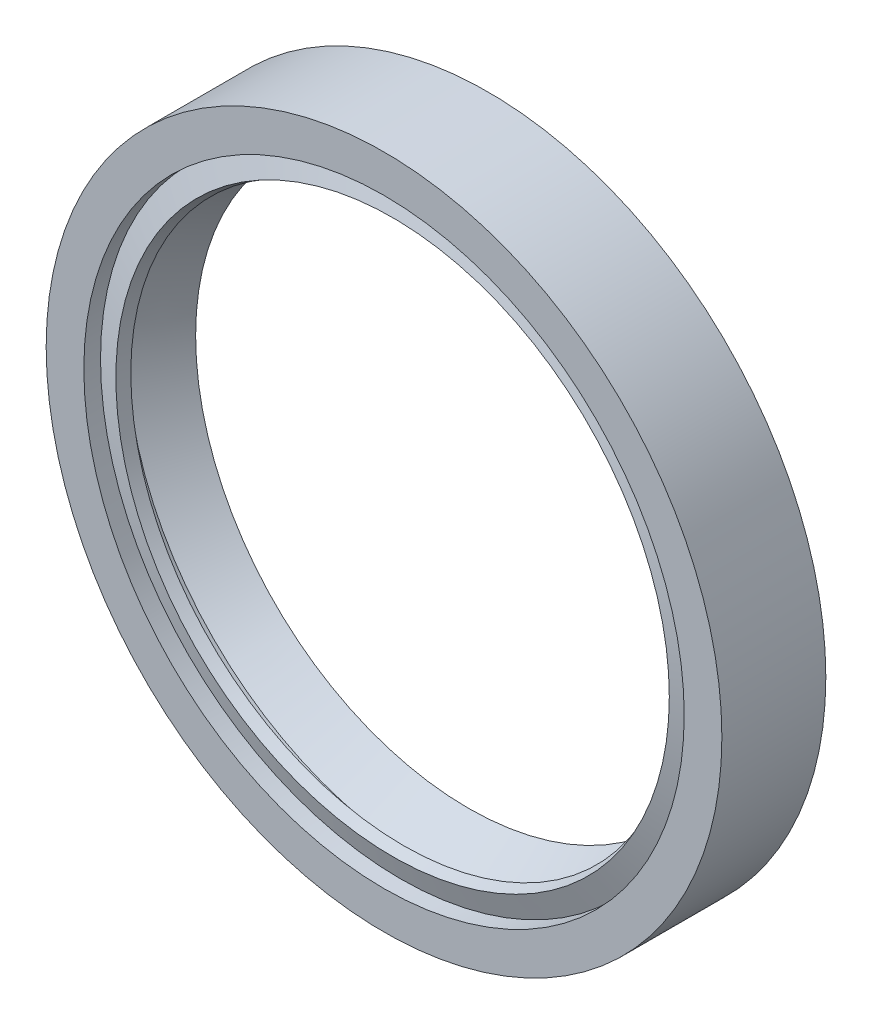
ISO-10303-21;
HEADER;
FILE_DESCRIPTION(('STEP AP214'),'2;1');
FILE_NAME('part.step','',(''),(''),'','','');
FILE_SCHEMA(('AUTOMOTIVE_DESIGN { 1 0 10303 214 1 1 1 1 }'));
ENDSEC;
DATA;
#1=APPLICATION_CONTEXT('core data for automotive mechanical design processes');
#2=APPLICATION_PROTOCOL_DEFINITION('international standard','automotive_design',2000,#1);
#3=PRODUCT_CONTEXT('',#1,'mechanical');
#4=PRODUCT('Part','Part','',(#3));
#5=PRODUCT_RELATED_PRODUCT_CATEGORY('part','',(#4));
#6=PRODUCT_DEFINITION_FORMATION('','',#4);
#7=PRODUCT_DEFINITION_CONTEXT('part definition',#1,'design');
#8=PRODUCT_DEFINITION('design','',#6,#7);
#9=PRODUCT_DEFINITION_SHAPE('','',#8);
#10=(LENGTH_UNIT() NAMED_UNIT(*) SI_UNIT(.MILLI.,.METRE.));
#11=(NAMED_UNIT(*) PLANE_ANGLE_UNIT() SI_UNIT($,.RADIAN.));
#12=(NAMED_UNIT(*) SI_UNIT($,.STERADIAN.) SOLID_ANGLE_UNIT());
#13=UNCERTAINTY_MEASURE_WITH_UNIT(LENGTH_MEASURE(1.E-05),#10,'distance_accuracy_value','');
#14=(GEOMETRIC_REPRESENTATION_CONTEXT(3) GLOBAL_UNCERTAINTY_ASSIGNED_CONTEXT((#13)) GLOBAL_UNIT_ASSIGNED_CONTEXT((#10,
#11,#12)) REPRESENTATION_CONTEXT('',''));
#15=CARTESIAN_POINT('',(0.,0.,0.));
#16=DIRECTION('',(0.,0.,1.));
#17=DIRECTION('',(1.,0.,0.));
#18=AXIS2_PLACEMENT_3D('',#15,#16,#17);
#19=CARTESIAN_POINT('',(0.,25.1876958763635,-8.));
#20=DIRECTION('',(0.,0.,1.));
#21=DIRECTION('',(1.,0.,0.));
#22=AXIS2_PLACEMENT_3D('',#19,#20,#21);
#23=PLANE('',#22);
#24=CARTESIAN_POINT('',(0.,0.,-8.));
#25=DIRECTION('',(0.,0.,1.));
#26=DIRECTION('',(1.,0.,0.));
#27=AXIS2_PLACEMENT_3D('',#24,#25,#26);
#28=CIRCLE('',#27,26.);
#29=CARTESIAN_POINT('',(26.,0.,-8.));
#30=VERTEX_POINT('',#29);
#31=EDGE_CURVE('E10',#30,#30,#28,.T.);
#32=ORIENTED_EDGE('',*,*,#31,.F.);
#33=EDGE_LOOP('',(#32));
#34=FACE_BOUND('',#33,.T.);
#35=CARTESIAN_POINT('',(0.,0.,-8.));
#36=DIRECTION('',(0.,0.,1.));
#37=DIRECTION('',(1.,0.,0.));
#38=AXIS2_PLACEMENT_3D('',#35,#36,#37);
#39=CIRCLE('',#38,25.1876958763635);
#40=CARTESIAN_POINT('',(25.1876958763635,0.,-8.));
#41=VERTEX_POINT('',#40);
#42=EDGE_CURVE('E77',#41,#41,#39,.T.);
#43=ORIENTED_EDGE('',*,*,#42,.T.);
#44=EDGE_LOOP('',(#43));
#45=FACE_BOUND('',#44,.T.);
#46=ADVANCED_FACE('F31',(#34,#45),#23,.F.);
#47=CARTESIAN_POINT('',(0.,0.,0.));
#48=DIRECTION('',(0.,0.,1.));
#49=DIRECTION('',(1.,0.,0.));
#50=AXIS2_PLACEMENT_3D('',#47,#48,#49);
#51=CYLINDRICAL_SURFACE('',#50,26.);
#52=CARTESIAN_POINT('',(0.,0.,0.));
#53=DIRECTION('',(0.,0.,1.));
#54=DIRECTION('',(1.,0.,0.));
#55=AXIS2_PLACEMENT_3D('',#52,#53,#54);
#56=CIRCLE('',#55,26.);
#57=CARTESIAN_POINT('',(26.,0.,0.));
#58=VERTEX_POINT('',#57);
#59=EDGE_CURVE('E37',#58,#58,#56,.T.);
#60=ORIENTED_EDGE('',*,*,#59,.F.);
#61=EDGE_LOOP('',(#60));
#62=FACE_BOUND('',#61,.T.);
#63=ORIENTED_EDGE('',*,*,#31,.T.);
#64=EDGE_LOOP('',(#63));
#65=FACE_BOUND('',#64,.T.);
#66=ADVANCED_FACE('F150',(#62,#65),#51,.T.);
#67=CARTESIAN_POINT('',(0.,26.,0.));
#68=DIRECTION('',(0.,0.,-1.));
#69=DIRECTION('',(-1.,0.,0.));
#70=AXIS2_PLACEMENT_3D('',#67,#68,#69);
#71=PLANE('',#70);
#72=CARTESIAN_POINT('',(0.,0.,0.));
#73=DIRECTION('',(0.,0.,1.));
#74=DIRECTION('',(1.,0.,0.));
#75=AXIS2_PLACEMENT_3D('',#72,#73,#74);
#76=CIRCLE('',#75,23.1012291454112);
#77=CARTESIAN_POINT('',(23.1012291454112,0.,0.));
#78=VERTEX_POINT('',#77);
#79=EDGE_CURVE('E41',#78,#78,#76,.T.);
#80=ORIENTED_EDGE('',*,*,#79,.F.);
#81=EDGE_LOOP('',(#80));
#82=FACE_BOUND('',#81,.T.);
#83=ORIENTED_EDGE('',*,*,#59,.T.);
#84=EDGE_LOOP('',(#83));
#85=FACE_BOUND('',#84,.T.);
#86=ADVANCED_FACE('F145',(#82,#85),#71,.F.);
#87=CARTESIAN_POINT('',(0.,0.,0.));
#88=DIRECTION('',(0.,0.,1.));
#89=DIRECTION('',(1.,0.,0.));
#90=AXIS2_PLACEMENT_3D('',#87,#88,#89);
#91=CYLINDRICAL_SURFACE('',#90,23.1012291454112);
#92=CARTESIAN_POINT('',(0.,0.,-1.28391446656906));
#93=DIRECTION('',(0.,0.,1.));
#94=DIRECTION('',(1.,0.,0.));
#95=AXIS2_PLACEMENT_3D('',#92,#93,#94);
#96=CIRCLE('',#95,23.1012291454112);
#97=CARTESIAN_POINT('',(23.1012291454112,0.,-1.28391446656906));
#98=VERTEX_POINT('',#97);
#99=EDGE_CURVE('E45',#98,#98,#96,.T.);
#100=ORIENTED_EDGE('',*,*,#99,.F.);
#101=EDGE_LOOP('',(#100));
#102=FACE_BOUND('',#101,.T.);
#103=ORIENTED_EDGE('',*,*,#79,.T.);
#104=EDGE_LOOP('',(#103));
#105=FACE_BOUND('',#104,.T.);
#106=ADVANCED_FACE('F139',(#102,#105),#91,.F.);
#107=CARTESIAN_POINT('',(0.,0.,-1.28391446656906));
#108=DIRECTION('',(0.,0.,-1.));
#109=DIRECTION('',(-1.,0.,0.));
#110=AXIS2_PLACEMENT_3D('',#107,#108,#109);
#111=CONICAL_SURFACE('',#110,23.1012291454112,1.23729560827876);
#112=CARTESIAN_POINT('',(0.,0.,-0.658486683729796));
#113=DIRECTION('',(0.,0.,1.));
#114=DIRECTION('',(1.,0.,0.));
#115=AXIS2_PLACEMENT_3D('',#112,#113,#114);
#116=CIRCLE('',#115,21.2959354352453);
#117=CARTESIAN_POINT('',(21.2959354352453,0.,-0.658486683729796));
#118=VERTEX_POINT('',#117);
#119=EDGE_CURVE('E50',#118,#118,#116,.T.);
#120=ORIENTED_EDGE('',*,*,#119,.F.);
#121=EDGE_LOOP('',(#120));
#122=FACE_BOUND('',#121,.T.);
#123=ORIENTED_EDGE('',*,*,#99,.T.);
#124=EDGE_LOOP('',(#123));
#125=FACE_BOUND('',#124,.T.);
#126=ADVANCED_FACE('F133',(#122,#125),#111,.T.);
#127=CARTESIAN_POINT('',(0.,0.,-0.658486683729796));
#128=DIRECTION('',(0.,0.,1.));
#129=DIRECTION('',(1.,0.,0.));
#130=AXIS2_PLACEMENT_3D('',#127,#128,#129);
#131=CONICAL_SURFACE('',#130,21.2959354352453,0.333500718516136);
#132=CARTESIAN_POINT('',(0.,0.,-1.51270262124093));
#133=DIRECTION('',(0.,0.,1.));
#134=DIRECTION('',(1.,0.,0.));
#135=AXIS2_PLACEMENT_3D('',#132,#133,#134);
#136=CIRCLE('',#135,21.);
#137=CARTESIAN_POINT('',(21.,0.,-1.51270262124093));
#138=VERTEX_POINT('',#137);
#139=EDGE_CURVE('E53',#138,#138,#136,.T.);
#140=ORIENTED_EDGE('',*,*,#139,.F.);
#141=EDGE_LOOP('',(#140));
#142=FACE_BOUND('',#141,.T.);
#143=ORIENTED_EDGE('',*,*,#119,.T.);
#144=EDGE_LOOP('',(#143));
#145=FACE_BOUND('',#144,.T.);
#146=ADVANCED_FACE('F127',(#142,#145),#131,.F.);
#147=CARTESIAN_POINT('',(0.,0.,-1.51270262124093));
#148=DIRECTION('',(0.,0.,-1.));
#149=DIRECTION('',(-1.,0.,0.));
#150=AXIS2_PLACEMENT_3D('',#147,#148,#149);
#151=CONICAL_SURFACE('',#150,21.,1.23729560827876);
#152=CARTESIAN_POINT('',(0.,0.,-2.24065457623389));
#153=DIRECTION('',(0.,0.,1.));
#154=DIRECTION('',(1.,0.,0.));
#155=AXIS2_PLACEMENT_3D('',#152,#153,#154);
#156=CIRCLE('',#155,23.1012291454112);
#157=CARTESIAN_POINT('',(23.1012291454112,0.,-2.24065457623389));
#158=VERTEX_POINT('',#157);
#159=EDGE_CURVE('E56',#158,#158,#156,.T.);
#160=ORIENTED_EDGE('',*,*,#159,.F.);
#161=EDGE_LOOP('',(#160));
#162=FACE_BOUND('',#161,.T.);
#163=ORIENTED_EDGE('',*,*,#139,.T.);
#164=EDGE_LOOP('',(#163));
#165=FACE_BOUND('',#164,.T.);
#166=ADVANCED_FACE('F121',(#162,#165),#151,.F.);
#167=CARTESIAN_POINT('',(0.,0.,0.));
#168=DIRECTION('',(0.,0.,1.));
#169=DIRECTION('',(1.,0.,0.));
#170=AXIS2_PLACEMENT_3D('',#167,#168,#169);
#171=CYLINDRICAL_SURFACE('',#170,23.1012291454112);
#172=CARTESIAN_POINT('',(0.,0.,-3.26716899412793));
#173=DIRECTION('',(0.,0.,1.));
#174=DIRECTION('',(1.,0.,0.));
#175=AXIS2_PLACEMENT_3D('',#172,#173,#174);
#176=CIRCLE('',#175,23.1012291454112);
#177=CARTESIAN_POINT('',(23.1012291454112,0.,-3.26716899412793));
#178=VERTEX_POINT('',#177);
#179=EDGE_CURVE('E59',#178,#178,#176,.T.);
#180=ORIENTED_EDGE('',*,*,#179,.F.);
#181=EDGE_LOOP('',(#180));
#182=FACE_BOUND('',#181,.T.);
#183=ORIENTED_EDGE('',*,*,#159,.T.);
#184=EDGE_LOOP('',(#183));
#185=FACE_BOUND('',#184,.T.);
#186=ADVANCED_FACE('F115',(#182,#185),#171,.F.);
#187=CARTESIAN_POINT('',(0.,0.,-3.26716899412793));
#188=DIRECTION('',(0.,0.,1.));
#189=DIRECTION('',(1.,0.,0.));
#190=AXIS2_PLACEMENT_3D('',#187,#188,#189);
#191=CONICAL_SURFACE('',#190,23.1012291454112,0.576102799671608);
#192=CARTESIAN_POINT('',(0.,0.,-6.50175728207016));
#193=DIRECTION('',(0.,0.,1.));
#194=DIRECTION('',(1.,0.,0.));
#195=AXIS2_PLACEMENT_3D('',#192,#193,#194);
#196=CIRCLE('',#195,21.);
#197=CARTESIAN_POINT('',(21.,0.,-6.50175728207016));
#198=VERTEX_POINT('',#197);
#199=EDGE_CURVE('E62',#198,#198,#196,.T.);
#200=ORIENTED_EDGE('',*,*,#199,.F.);
#201=EDGE_LOOP('',(#200));
#202=FACE_BOUND('',#201,.T.);
#203=ORIENTED_EDGE('',*,*,#179,.T.);
#204=EDGE_LOOP('',(#203));
#205=FACE_BOUND('',#204,.T.);
#206=ADVANCED_FACE('F109',(#202,#205),#191,.F.);
#207=CARTESIAN_POINT('',(0.,0.,-6.50175728207016));
#208=DIRECTION('',(0.,0.,-1.));
#209=DIRECTION('',(-1.,0.,0.));
#210=AXIS2_PLACEMENT_3D('',#207,#208,#209);
#211=CONICAL_SURFACE('',#210,21.,0.964986010238033);
#212=CARTESIAN_POINT('',(0.,0.,-8.));
#213=DIRECTION('',(0.,0.,1.));
#214=DIRECTION('',(1.,0.,0.));
#215=AXIS2_PLACEMENT_3D('',#212,#213,#214);
#216=CIRCLE('',#215,23.1629004075565);
#217=CARTESIAN_POINT('',(23.1629004075565,0.,-8.));
#218=VERTEX_POINT('',#217);
#219=EDGE_CURVE('E65',#218,#218,#216,.T.);
#220=ORIENTED_EDGE('',*,*,#219,.F.);
#221=EDGE_LOOP('',(#220));
#222=FACE_BOUND('',#221,.T.);
#223=ORIENTED_EDGE('',*,*,#199,.T.);
#224=EDGE_LOOP('',(#223));
#225=FACE_BOUND('',#224,.T.);
#226=ADVANCED_FACE('F103',(#222,#225),#211,.F.);
#227=CARTESIAN_POINT('',(0.,23.1629004075565,-8.));
#228=DIRECTION('',(0.,0.,1.));
#229=DIRECTION('',(1.,0.,0.));
#230=AXIS2_PLACEMENT_3D('',#227,#228,#229);
#231=PLANE('',#230);
#232=CARTESIAN_POINT('',(0.,0.,-8.));
#233=DIRECTION('',(0.,0.,1.));
#234=DIRECTION('',(1.,0.,0.));
#235=AXIS2_PLACEMENT_3D('',#232,#233,#234);
#236=CIRCLE('',#235,24.2561311684476);
#237=CARTESIAN_POINT('',(24.2561311684476,0.,-8.));
#238=VERTEX_POINT('',#237);
#239=EDGE_CURVE('E68',#238,#238,#236,.T.);
#240=ORIENTED_EDGE('',*,*,#239,.F.);
#241=EDGE_LOOP('',(#240));
#242=FACE_BOUND('',#241,.T.);
#243=ORIENTED_EDGE('',*,*,#219,.T.);
#244=EDGE_LOOP('',(#243));
#245=FACE_BOUND('',#244,.T.);
#246=ADVANCED_FACE('F97',(#242,#245),#231,.F.);
#247=CARTESIAN_POINT('',(0.,0.,0.));
#248=DIRECTION('',(0.,0.,1.));
#249=DIRECTION('',(1.,0.,0.));
#250=AXIS2_PLACEMENT_3D('',#247,#248,#249);
#251=CYLINDRICAL_SURFACE('',#250,24.2561311684476);
#252=CARTESIAN_POINT('',(0.,0.,-1.75105550840637));
#253=DIRECTION('',(0.,0.,1.));
#254=DIRECTION('',(1.,0.,0.));
#255=AXIS2_PLACEMENT_3D('',#252,#253,#254);
#256=CIRCLE('',#255,24.2561311684476);
#257=CARTESIAN_POINT('',(24.2561311684476,0.,-1.75105550840637));
#258=VERTEX_POINT('',#257);
#259=EDGE_CURVE('E71',#258,#258,#256,.T.);
#260=ORIENTED_EDGE('',*,*,#259,.F.);
#261=EDGE_LOOP('',(#260));
#262=FACE_BOUND('',#261,.T.);
#263=ORIENTED_EDGE('',*,*,#239,.T.);
#264=EDGE_LOOP('',(#263));
#265=FACE_BOUND('',#264,.T.);
#266=ADVANCED_FACE('F91',(#262,#265),#251,.T.);
#267=CARTESIAN_POINT('',(0.,24.2561311684476,-1.75105550840637));
#268=DIRECTION('',(0.,0.,1.));
#269=DIRECTION('',(1.,0.,0.));
#270=AXIS2_PLACEMENT_3D('',#267,#268,#269);
#271=PLANE('',#270);
#272=CARTESIAN_POINT('',(0.,0.,-1.75105550840637));
#273=DIRECTION('',(0.,0.,1.));
#274=DIRECTION('',(1.,0.,0.));
#275=AXIS2_PLACEMENT_3D('',#272,#273,#274);
#276=CIRCLE('',#275,25.1876958763635);
#277=CARTESIAN_POINT('',(25.1876958763635,0.,-1.75105550840637));
#278=VERTEX_POINT('',#277);
#279=EDGE_CURVE('E74',#278,#278,#276,.T.);
#280=ORIENTED_EDGE('',*,*,#279,.F.);
#281=EDGE_LOOP('',(#280));
#282=FACE_BOUND('',#281,.T.);
#283=ORIENTED_EDGE('',*,*,#259,.T.);
#284=EDGE_LOOP('',(#283));
#285=FACE_BOUND('',#284,.T.);
#286=ADVANCED_FACE('F85',(#282,#285),#271,.F.);
#287=CARTESIAN_POINT('',(0.,0.,0.));
#288=DIRECTION('',(0.,0.,1.));
#289=DIRECTION('',(1.,0.,0.));
#290=AXIS2_PLACEMENT_3D('',#287,#288,#289);
#291=CYLINDRICAL_SURFACE('',#290,25.1876958763635);
#292=ORIENTED_EDGE('',*,*,#42,.F.);
#293=EDGE_LOOP('',(#292));
#294=FACE_BOUND('',#293,.T.);
#295=ORIENTED_EDGE('',*,*,#279,.T.);
#296=EDGE_LOOP('',(#295));
#297=FACE_BOUND('',#296,.T.);
#298=ADVANCED_FACE('F82',(#294,#297),#291,.F.);
#299=CLOSED_SHELL('',(#46,#66,#86,#106,#126,#146,#166,#186,#206,#226,#246,#266,#286,#298));
#300=MANIFOLD_SOLID_BREP('B2',#299);
#301=ADVANCED_BREP_SHAPE_REPRESENTATION('',(#18,#300),#14);
#302=SHAPE_DEFINITION_REPRESENTATION(#9,#301);
ENDSEC;
END-ISO-10303-21;
